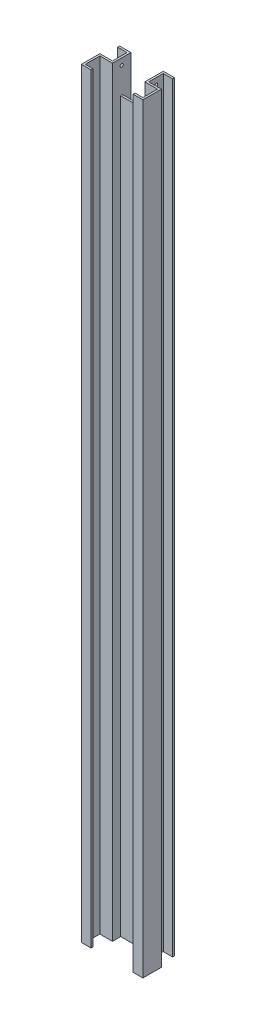
ISO-10303-21;
HEADER;
FILE_DESCRIPTION(('STEP AP214'),'2;1');
FILE_NAME('part.step','',(''),(''),'','','');
FILE_SCHEMA(('AUTOMOTIVE_DESIGN { 1 0 10303 214 1 1 1 1 }'));
ENDSEC;
DATA;
#1=APPLICATION_CONTEXT('core data for automotive mechanical design processes');
#2=APPLICATION_PROTOCOL_DEFINITION('international standard','automotive_design',2000,#1);
#3=PRODUCT_CONTEXT('',#1,'mechanical');
#4=PRODUCT('Part','Part','',(#3));
#5=PRODUCT_RELATED_PRODUCT_CATEGORY('part','',(#4));
#6=PRODUCT_DEFINITION_FORMATION('','',#4);
#7=PRODUCT_DEFINITION_CONTEXT('part definition',#1,'design');
#8=PRODUCT_DEFINITION('design','',#6,#7);
#9=PRODUCT_DEFINITION_SHAPE('','',#8);
#10=(LENGTH_UNIT() NAMED_UNIT(*) SI_UNIT(.MILLI.,.METRE.));
#11=(NAMED_UNIT(*) PLANE_ANGLE_UNIT() SI_UNIT($,.RADIAN.));
#12=(NAMED_UNIT(*) SI_UNIT($,.STERADIAN.) SOLID_ANGLE_UNIT());
#13=UNCERTAINTY_MEASURE_WITH_UNIT(LENGTH_MEASURE(1.E-05),#10,'distance_accuracy_value','');
#14=(GEOMETRIC_REPRESENTATION_CONTEXT(3) GLOBAL_UNCERTAINTY_ASSIGNED_CONTEXT((#13)) GLOBAL_UNIT_ASSIGNED_CONTEXT((#10,
#11,#12)) REPRESENTATION_CONTEXT('',''));
#15=CARTESIAN_POINT('',(0.,0.,0.));
#16=DIRECTION('',(0.,0.,1.));
#17=DIRECTION('',(1.,0.,0.));
#18=AXIS2_PLACEMENT_3D('',#15,#16,#17);
#19=CARTESIAN_POINT('',(-56.,-5.00000001402157E-05,-51.));
#20=DIRECTION('',(1.,0.,0.));
#21=DIRECTION('',(0.,0.,-1.));
#22=AXIS2_PLACEMENT_3D('',#19,#20,#21);
#23=PLANE('',#22);
#24=CARTESIAN_POINT('',(-56.,2330.,-73.5));
#25=DIRECTION('',(-1.,0.,0.));
#26=DIRECTION('',(0.,0.,1.));
#27=AXIS2_PLACEMENT_3D('',#24,#25,#26);
#28=CIRCLE('',#27,4.99999999999989);
#29=CARTESIAN_POINT('',(-56.,2330.,-68.5000000000001));
#30=VERTEX_POINT('',#29);
#31=EDGE_CURVE('E561',#30,#30,#28,.T.);
#32=ORIENTED_EDGE('',*,*,#31,.F.);
#33=EDGE_LOOP('',(#32));
#34=FACE_BOUND('',#33,.T.);
#35=DIRECTION('',(0.,1.,0.));
#36=VECTOR('',#35,1.);
#37=CARTESIAN_POINT('',(-56.,2350.,-96.));
#38=LINE('',#37,#36);
#39=CARTESIAN_POINT('',(-56.,0.,-96.));
#40=VERTEX_POINT('',#39);
#41=CARTESIAN_POINT('',(-56.,2350.,-96.));
#42=VERTEX_POINT('',#41);
#43=EDGE_CURVE('E243',#40,#42,#38,.T.);
#44=ORIENTED_EDGE('',*,*,#43,.F.);
#45=DIRECTION('',(0.,0.,1.));
#46=VECTOR('',#45,1.);
#47=CARTESIAN_POINT('',(-56.,0.,-44.9999999999998));
#48=LINE('',#47,#46);
#49=CARTESIAN_POINT('',(-56.,0.,-51.));
#50=VERTEX_POINT('',#49);
#51=EDGE_CURVE('E258',#40,#50,#48,.T.);
#52=ORIENTED_EDGE('',*,*,#51,.T.);
#53=DIRECTION('',(0.,1.,0.));
#54=VECTOR('',#53,1.);
#55=CARTESIAN_POINT('',(-56.,-5.00000001402157E-05,-51.));
#56=LINE('',#55,#54);
#57=CARTESIAN_POINT('',(-56.,2350.,-51.));
#58=VERTEX_POINT('',#57);
#59=EDGE_CURVE('E256',#50,#58,#56,.T.);
#60=ORIENTED_EDGE('',*,*,#59,.T.);
#61=DIRECTION('',(0.,0.,-1.));
#62=VECTOR('',#61,1.);
#63=CARTESIAN_POINT('',(-56.,2350.,-51.));
#64=LINE('',#63,#62);
#65=EDGE_CURVE('E51',#58,#42,#64,.T.);
#66=ORIENTED_EDGE('',*,*,#65,.T.);
#67=EDGE_LOOP('',(#44,#52,#60,#66));
#68=FACE_BOUND('',#67,.T.);
#69=ADVANCED_FACE('F34',(#34,#68),#23,.F.);
#70=CARTESIAN_POINT('',(0.,0.,-76.5));
#71=DIRECTION('',(0.,0.,-1.));
#72=DIRECTION('',(-1.,0.,0.));
#73=AXIS2_PLACEMENT_3D('',#70,#71,#72);
#74=PLANE('',#73);
#75=DIRECTION('',(-1.,0.,0.));
#76=VECTOR('',#75,1.);
#77=CARTESIAN_POINT('',(95.,0.,-76.5));
#78=LINE('',#77,#76);
#79=CARTESIAN_POINT('',(49.9999999999997,0.,-76.5));
#80=VERTEX_POINT('',#79);
#81=CARTESIAN_POINT('',(-50.0000000000004,0.,-76.5000000000002));
#82=VERTEX_POINT('',#81);
#83=EDGE_CURVE('E423',#80,#82,#78,.T.);
#84=ORIENTED_EDGE('',*,*,#83,.T.);
#85=DIRECTION('',(0.,-1.,0.));
#86=VECTOR('',#85,1.);
#87=CARTESIAN_POINT('',(-50.0000000000004,0.,-76.5000000000002));
#88=LINE('',#87,#86);
#89=CARTESIAN_POINT('',(-50.0000000000004,2250.,-76.5000000000002));
#90=VERTEX_POINT('',#89);
#91=EDGE_CURVE('E263',#90,#82,#88,.T.);
#92=ORIENTED_EDGE('',*,*,#91,.F.);
#93=DIRECTION('',(-1.,0.,0.));
#94=VECTOR('',#93,1.);
#95=CARTESIAN_POINT('',(50.,2250.,-76.5));
#96=LINE('',#95,#94);
#97=CARTESIAN_POINT('',(50.,2250.,-76.5));
#98=VERTEX_POINT('',#97);
#99=EDGE_CURVE('E320',#98,#90,#96,.T.);
#100=ORIENTED_EDGE('',*,*,#99,.F.);
#101=DIRECTION('',(0.,1.,0.));
#102=VECTOR('',#101,1.);
#103=CARTESIAN_POINT('',(49.9999999999997,2350.,-76.4999999999998));
#104=LINE('',#103,#102);
#105=EDGE_CURVE('E303',#80,#98,#104,.T.);
#106=ORIENTED_EDGE('',*,*,#105,.F.);
#107=EDGE_LOOP('',(#84,#92,#100,#106));
#108=FACE_BOUND('',#107,.T.);
#109=ADVANCED_FACE('F512',(#108),#74,.T.);
#110=CARTESIAN_POINT('',(56.,2350.,-51.));
#111=DIRECTION('',(-1.,0.,0.));
#112=DIRECTION('',(0.,0.,1.));
#113=AXIS2_PLACEMENT_3D('',#110,#111,#112);
#114=PLANE('',#113);
#115=CARTESIAN_POINT('',(56.,2330.,-73.5));
#116=DIRECTION('',(-1.,0.,0.));
#117=DIRECTION('',(0.,0.,1.));
#118=AXIS2_PLACEMENT_3D('',#115,#116,#117);
#119=CIRCLE('',#118,4.99999999999989);
#120=CARTESIAN_POINT('',(56.,2330.,-68.5000000000001));
#121=VERTEX_POINT('',#120);
#122=EDGE_CURVE('E564',#121,#121,#119,.T.);
#123=ORIENTED_EDGE('',*,*,#122,.T.);
#124=EDGE_LOOP('',(#123));
#125=FACE_BOUND('',#124,.T.);
#126=DIRECTION('',(0.,-1.,0.));
#127=VECTOR('',#126,1.);
#128=CARTESIAN_POINT('',(56.,0.,-96.));
#129=LINE('',#128,#127);
#130=CARTESIAN_POINT('',(56.,2350.,-96.));
#131=VERTEX_POINT('',#130);
#132=CARTESIAN_POINT('',(56.,0.,-96.));
#133=VERTEX_POINT('',#132);
#134=EDGE_CURVE('E59',#131,#133,#129,.T.);
#135=ORIENTED_EDGE('',*,*,#134,.F.);
#136=DIRECTION('',(0.,0.,-1.));
#137=VECTOR('',#136,1.);
#138=CARTESIAN_POINT('',(56.,2350.,-51.));
#139=LINE('',#138,#137);
#140=CARTESIAN_POINT('',(56.,2350.,-51.));
#141=VERTEX_POINT('',#140);
#142=EDGE_CURVE('E294',#141,#131,#139,.T.);
#143=ORIENTED_EDGE('',*,*,#142,.F.);
#144=DIRECTION('',(0.,-1.,0.));
#145=VECTOR('',#144,1.);
#146=CARTESIAN_POINT('',(56.,2350.,-51.));
#147=LINE('',#146,#145);
#148=CARTESIAN_POINT('',(56.,0.,-51.));
#149=VERTEX_POINT('',#148);
#150=EDGE_CURVE('E301',#141,#149,#147,.T.);
#151=ORIENTED_EDGE('',*,*,#150,.T.);
#152=DIRECTION('',(0.,0.,-1.));
#153=VECTOR('',#152,1.);
#154=CARTESIAN_POINT('',(56.,0.,-51.));
#155=LINE('',#154,#153);
#156=EDGE_CURVE('E295',#149,#133,#155,.T.);
#157=ORIENTED_EDGE('',*,*,#156,.T.);
#158=EDGE_LOOP('',(#135,#143,#151,#157));
#159=FACE_BOUND('',#158,.T.);
#160=ADVANCED_FACE('F485',(#125,#159),#114,.F.);
#161=CARTESIAN_POINT('',(49.9999999999999,2350.,-44.9999999999999));
#162=DIRECTION('',(0.,1.,0.));
#163=DIRECTION('',(0.,0.,1.));
#164=AXIS2_PLACEMENT_3D('',#161,#162,#163);
#165=PLANE('',#164);
#166=ORIENTED_EDGE('',*,*,#142,.T.);
#167=DIRECTION('',(-1.,0.,0.));
#168=VECTOR('',#167,1.);
#169=CARTESIAN_POINT('',(85.,2350.,-96.));
#170=LINE('',#169,#168);
#171=CARTESIAN_POINT('',(85.,2350.,-96.));
#172=VERTEX_POINT('',#171);
#173=EDGE_CURVE('E287',#172,#131,#170,.T.);
#174=ORIENTED_EDGE('',*,*,#173,.F.);
#175=DIRECTION('',(0.,0.,1.));
#176=VECTOR('',#175,1.);
#177=CARTESIAN_POINT('',(85.,2350.,-96.));
#178=LINE('',#177,#176);
#179=CARTESIAN_POINT('',(85.,2350.,-102.));
#180=VERTEX_POINT('',#179);
#181=EDGE_CURVE('E276',#180,#172,#178,.T.);
#182=ORIENTED_EDGE('',*,*,#181,.F.);
#183=DIRECTION('',(1.,0.,0.));
#184=VECTOR('',#183,1.);
#185=CARTESIAN_POINT('',(94.9999999999998,2350.,-102.));
#186=LINE('',#185,#184);
#187=CARTESIAN_POINT('',(49.9999999999998,2350.,-102.));
#188=VERTEX_POINT('',#187);
#189=EDGE_CURVE('E310',#188,#180,#186,.T.);
#190=ORIENTED_EDGE('',*,*,#189,.F.);
#191=DIRECTION('',(0.,0.,-1.));
#192=VECTOR('',#191,1.);
#193=CARTESIAN_POINT('',(49.9999999999999,2350.,-44.9999999999999));
#194=LINE('',#193,#192);
#195=CARTESIAN_POINT('',(49.9999999999999,2350.,-44.9999999999999));
#196=VERTEX_POINT('',#195);
#197=EDGE_CURVE('E43',#196,#188,#194,.T.);
#198=ORIENTED_EDGE('',*,*,#197,.F.);
#199=DIRECTION('',(1.,0.,0.));
#200=VECTOR('',#199,1.);
#201=CARTESIAN_POINT('',(49.9999999999999,2350.,-44.9999999999999));
#202=LINE('',#201,#200);
#203=CARTESIAN_POINT('',(88.9999999999998,2350.,-44.9999999999998));
#204=VERTEX_POINT('',#203);
#205=EDGE_CURVE('E430',#196,#204,#202,.T.);
#206=ORIENTED_EDGE('',*,*,#205,.T.);
#207=DIRECTION('',(0.,0.,-1.));
#208=VECTOR('',#207,1.);
#209=CARTESIAN_POINT('',(88.9999999999998,2350.,6.00000000000016));
#210=LINE('',#209,#208);
#211=CARTESIAN_POINT('',(88.9999999999998,2350.,2.00805084366041E-12));
#212=VERTEX_POINT('',#211);
#213=EDGE_CURVE('E382',#212,#204,#210,.T.);
#214=ORIENTED_EDGE('',*,*,#213,.F.);
#215=DIRECTION('',(1.,0.,0.));
#216=VECTOR('',#215,1.);
#217=CARTESIAN_POINT('',(64.9999999999998,2350.,2.00805084366041E-12));
#218=LINE('',#217,#216);
#219=CARTESIAN_POINT('',(64.9999999999998,2350.,2.00805084366041E-12));
#220=VERTEX_POINT('',#219);
#221=EDGE_CURVE('E371',#220,#212,#218,.T.);
#222=ORIENTED_EDGE('',*,*,#221,.F.);
#223=DIRECTION('',(0.,0.,-1.));
#224=VECTOR('',#223,1.);
#225=CARTESIAN_POINT('',(64.9999999999998,2350.,2.00805084366041E-12));
#226=LINE('',#225,#224);
#227=CARTESIAN_POINT('',(64.9999999999998,2350.,6.));
#228=VERTEX_POINT('',#227);
#229=EDGE_CURVE('E360',#228,#220,#226,.T.);
#230=ORIENTED_EDGE('',*,*,#229,.F.);
#231=DIRECTION('',(-1.,0.,0.));
#232=VECTOR('',#231,1.);
#233=CARTESIAN_POINT('',(88.9999999999998,2350.,6.00000000000016));
#234=LINE('',#233,#232);
#235=CARTESIAN_POINT('',(94.9999999999998,2350.,6.00000000000016));
#236=VERTEX_POINT('',#235);
#237=EDGE_CURVE('E380',#236,#228,#234,.T.);
#238=ORIENTED_EDGE('',*,*,#237,.F.);
#239=DIRECTION('',(0.,0.,-1.));
#240=VECTOR('',#239,1.);
#241=CARTESIAN_POINT('',(95.,2350.,-44.9999999999999));
#242=LINE('',#241,#240);
#243=CARTESIAN_POINT('',(95.,2350.,-51.));
#244=VERTEX_POINT('',#243);
#245=EDGE_CURVE('E11',#236,#244,#242,.T.);
#246=ORIENTED_EDGE('',*,*,#245,.T.);
#247=DIRECTION('',(-1.,0.,0.));
#248=VECTOR('',#247,1.);
#249=CARTESIAN_POINT('',(95.,2350.,-51.));
#250=LINE('',#249,#248);
#251=EDGE_CURVE('E291',#244,#141,#250,.T.);
#252=ORIENTED_EDGE('',*,*,#251,.T.);
#253=EDGE_LOOP('',(#166,#174,#182,#190,#198,#206,#214,#222,#230,#238,#246,#252));
#254=FACE_BOUND('',#253,.T.);
#255=ADVANCED_FACE('F466',(#254),#165,.T.);
#256=CARTESIAN_POINT('',(-95.0000000000001,2350.,-70.4999999999997));
#257=DIRECTION('',(0.,0.,-1.));
#258=DIRECTION('',(-1.,0.,0.));
#259=AXIS2_PLACEMENT_3D('',#256,#257,#258);
#260=PLANE('',#259);
#261=DIRECTION('',(1.,0.,0.));
#262=VECTOR('',#261,1.);
#263=CARTESIAN_POINT('',(-50.,2250.,-70.5));
#264=LINE('',#263,#262);
#265=CARTESIAN_POINT('',(-50.,2250.,-70.5));
#266=VERTEX_POINT('',#265);
#267=CARTESIAN_POINT('',(50.,2250.,-70.5));
#268=VERTEX_POINT('',#267);
#269=EDGE_CURVE('E319',#266,#268,#264,.T.);
#270=ORIENTED_EDGE('',*,*,#269,.F.);
#271=DIRECTION('',(0.,1.,0.));
#272=VECTOR('',#271,1.);
#273=CARTESIAN_POINT('',(-50.,2350.,-70.4999999999997));
#274=LINE('',#273,#272);
#275=CARTESIAN_POINT('',(-50.,0.,-70.4999999999997));
#276=VERTEX_POINT('',#275);
#277=EDGE_CURVE('E388',#276,#266,#274,.T.);
#278=ORIENTED_EDGE('',*,*,#277,.F.);
#279=DIRECTION('',(1.,0.,0.));
#280=VECTOR('',#279,1.);
#281=CARTESIAN_POINT('',(-95.0000000000001,0.,-70.4999999999997));
#282=LINE('',#281,#280);
#283=CARTESIAN_POINT('',(49.9999999999999,0.,-70.4999999999997));
#284=VERTEX_POINT('',#283);
#285=EDGE_CURVE('E409',#276,#284,#282,.T.);
#286=ORIENTED_EDGE('',*,*,#285,.T.);
#287=DIRECTION('',(0.,1.,0.));
#288=VECTOR('',#287,1.);
#289=CARTESIAN_POINT('',(49.9999999999999,2350.,-70.4999999999997));
#290=LINE('',#289,#288);
#291=EDGE_CURVE('E403',#284,#268,#290,.T.);
#292=ORIENTED_EDGE('',*,*,#291,.T.);
#293=EDGE_LOOP('',(#270,#278,#286,#292));
#294=FACE_BOUND('',#293,.T.);
#295=ADVANCED_FACE('F520',(#294),#260,.F.);
#296=CARTESIAN_POINT('',(-50.,2350.,6.00000000000024));
#297=DIRECTION('',(-1.,0.,0.));
#298=DIRECTION('',(0.,0.,1.));
#299=AXIS2_PLACEMENT_3D('',#296,#297,#298);
#300=PLANE('',#299);
#301=CARTESIAN_POINT('',(-50.,2330.,-73.5));
#302=DIRECTION('',(-1.,0.,0.));
#303=DIRECTION('',(0.,0.,1.));
#304=AXIS2_PLACEMENT_3D('',#301,#302,#303);
#305=CIRCLE('',#304,4.99999999999989);
#306=CARTESIAN_POINT('',(-50.,2330.,-68.5000000000001));
#307=VERTEX_POINT('',#306);
#308=EDGE_CURVE('E554',#307,#307,#305,.T.);
#309=ORIENTED_EDGE('',*,*,#308,.T.);
#310=EDGE_LOOP('',(#309));
#311=FACE_BOUND('',#310,.T.);
#312=DIRECTION('',(0.,1.,0.));
#313=VECTOR('',#312,1.);
#314=CARTESIAN_POINT('',(-50.,0.,-45.));
#315=LINE('',#314,#313);
#316=CARTESIAN_POINT('',(-50.,0.,-45.));
#317=VERTEX_POINT('',#316);
#318=CARTESIAN_POINT('',(-50.,2350.,-45.));
#319=VERTEX_POINT('',#318);
#320=EDGE_CURVE('E329',#317,#319,#315,.T.);
#321=ORIENTED_EDGE('',*,*,#320,.F.);
#322=DIRECTION('',(0.,0.,-1.));
#323=VECTOR('',#322,1.);
#324=CARTESIAN_POINT('',(-50.,0.,6.00000000000024));
#325=LINE('',#324,#323);
#326=EDGE_CURVE('E397',#317,#276,#325,.T.);
#327=ORIENTED_EDGE('',*,*,#326,.T.);
#328=ORIENTED_EDGE('',*,*,#277,.T.);
#329=DIRECTION('',(0.,0.,1.));
#330=VECTOR('',#329,1.);
#331=CARTESIAN_POINT('',(-50.0000000000001,2250.,-76.5));
#332=LINE('',#331,#330);
#333=EDGE_CURVE('E317',#90,#266,#332,.T.);
#334=ORIENTED_EDGE('',*,*,#333,.F.);
#335=ORIENTED_EDGE('',*,*,#91,.T.);
#336=DIRECTION('',(0.,0.,1.));
#337=VECTOR('',#336,1.);
#338=CARTESIAN_POINT('',(-50.0000000000003,0.,-102.));
#339=LINE('',#338,#337);
#340=CARTESIAN_POINT('',(-50.0000000000003,0.,-102.));
#341=VERTEX_POINT('',#340);
#342=EDGE_CURVE('E269',#341,#82,#339,.T.);
#343=ORIENTED_EDGE('',*,*,#342,.F.);
#344=DIRECTION('',(0.,-1.,0.));
#345=VECTOR('',#344,1.);
#346=CARTESIAN_POINT('',(-50.0000000000003,0.,-102.));
#347=LINE('',#346,#345);
#348=CARTESIAN_POINT('',(-50.0000000000003,2350.,-102.));
#349=VERTEX_POINT('',#348);
#350=EDGE_CURVE('E265',#349,#341,#347,.T.);
#351=ORIENTED_EDGE('',*,*,#350,.F.);
#352=DIRECTION('',(0.,0.,-1.));
#353=VECTOR('',#352,1.);
#354=CARTESIAN_POINT('',(-50.,2350.,6.00000000000024));
#355=LINE('',#354,#353);
#356=EDGE_CURVE('E401',#319,#349,#355,.T.);
#357=ORIENTED_EDGE('',*,*,#356,.F.);
#358=EDGE_LOOP('',(#321,#327,#328,#334,#335,#343,#351,#357));
#359=FACE_BOUND('',#358,.T.);
#360=ADVANCED_FACE('F516',(#311,#359),#300,.F.);
#361=ORIENTED_EDGE('',*,*,#65,.F.);
#362=DIRECTION('',(1.,0.,0.));
#363=VECTOR('',#362,1.);
#364=CARTESIAN_POINT('',(-95.,2350.,-51.));
#365=LINE('',#364,#363);
#366=CARTESIAN_POINT('',(-95.,2350.,-51.));
#367=VERTEX_POINT('',#366);
#368=EDGE_CURVE('E246',#367,#58,#365,.T.);
#369=ORIENTED_EDGE('',*,*,#368,.F.);
#370=DIRECTION('',(0.,0.,-1.));
#371=VECTOR('',#370,1.);
#372=CARTESIAN_POINT('',(-95.0000000000001,2350.,-76.5000000000003));
#373=LINE('',#372,#371);
#374=CARTESIAN_POINT('',(-95.,2350.,6.00000000000024));
#375=VERTEX_POINT('',#374);
#376=EDGE_CURVE('E404',#375,#367,#373,.T.);
#377=ORIENTED_EDGE('',*,*,#376,.F.);
#378=DIRECTION('',(-1.,0.,0.));
#379=VECTOR('',#378,1.);
#380=CARTESIAN_POINT('',(-95.,2350.,6.00000000000024));
#381=LINE('',#380,#379);
#382=CARTESIAN_POINT('',(-65.,2350.,6.00000000000024));
#383=VERTEX_POINT('',#382);
#384=EDGE_CURVE('E389',#383,#375,#381,.T.);
#385=ORIENTED_EDGE('',*,*,#384,.F.);
#386=DIRECTION('',(0.,0.,1.));
#387=VECTOR('',#386,1.);
#388=CARTESIAN_POINT('',(-65.,2350.,5.27355936696949E-13));
#389=LINE('',#388,#387);
#390=CARTESIAN_POINT('',(-65.,2350.,5.27355936696949E-13));
#391=VERTEX_POINT('',#390);
#392=EDGE_CURVE('E350',#391,#383,#389,.T.);
#393=ORIENTED_EDGE('',*,*,#392,.F.);
#394=DIRECTION('',(-1.,0.,0.));
#395=VECTOR('',#394,1.);
#396=CARTESIAN_POINT('',(-50.,2350.,0.));
#397=LINE('',#396,#395);
#398=CARTESIAN_POINT('',(-89.,2350.,0.));
#399=VERTEX_POINT('',#398);
#400=EDGE_CURVE('E327',#391,#399,#397,.T.);
#401=ORIENTED_EDGE('',*,*,#400,.T.);
#402=DIRECTION('',(0.,0.,1.));
#403=VECTOR('',#402,1.);
#404=CARTESIAN_POINT('',(-89.,2350.,-45.));
#405=LINE('',#404,#403);
#406=CARTESIAN_POINT('',(-89.,2350.,-45.));
#407=VERTEX_POINT('',#406);
#408=EDGE_CURVE('E343',#407,#399,#405,.T.);
#409=ORIENTED_EDGE('',*,*,#408,.F.);
#410=DIRECTION('',(-1.,0.,0.));
#411=VECTOR('',#410,1.);
#412=CARTESIAN_POINT('',(-50.,2350.,-45.));
#413=LINE('',#412,#411);
#414=EDGE_CURVE('E331',#319,#407,#413,.T.);
#415=ORIENTED_EDGE('',*,*,#414,.F.);
#416=ORIENTED_EDGE('',*,*,#356,.T.);
#417=DIRECTION('',(1.,0.,0.));
#418=VECTOR('',#417,1.);
#419=CARTESIAN_POINT('',(-50.0000000000003,2350.,-102.));
#420=LINE('',#419,#418);
#421=CARTESIAN_POINT('',(-85.,2350.,-102.));
#422=VERTEX_POINT('',#421);
#423=EDGE_CURVE('E229',#422,#349,#420,.T.);
#424=ORIENTED_EDGE('',*,*,#423,.F.);
#425=DIRECTION('',(0.,0.,-1.));
#426=VECTOR('',#425,1.);
#427=CARTESIAN_POINT('',(-85.,2350.,-102.));
#428=LINE('',#427,#426);
#429=CARTESIAN_POINT('',(-85.,2350.,-96.));
#430=VERTEX_POINT('',#429);
#431=EDGE_CURVE('E222',#430,#422,#428,.T.);
#432=ORIENTED_EDGE('',*,*,#431,.F.);
#433=DIRECTION('',(1.,0.,0.));
#434=VECTOR('',#433,1.);
#435=CARTESIAN_POINT('',(-85.,2350.,-96.));
#436=LINE('',#435,#434);
#437=EDGE_CURVE('E226',#430,#42,#436,.T.);
#438=ORIENTED_EDGE('',*,*,#437,.T.);
#439=EDGE_LOOP('',(#361,#369,#377,#385,#393,#401,#409,#415,#416,#424,#432,#438));
#440=FACE_BOUND('',#439,.T.);
#441=ADVANCED_FACE('F224',(#440),#165,.T.);
#442=CARTESIAN_POINT('',(95.,0.,-44.9999999999999));
#443=DIRECTION('',(0.,-1.,0.));
#444=DIRECTION('',(0.,0.,-1.));
#445=AXIS2_PLACEMENT_3D('',#442,#443,#444);
#446=PLANE('',#445);
#447=ORIENTED_EDGE('',*,*,#51,.F.);
#448=DIRECTION('',(1.,0.,0.));
#449=VECTOR('',#448,1.);
#450=CARTESIAN_POINT('',(-85.,0.,-96.));
#451=LINE('',#450,#449);
#452=CARTESIAN_POINT('',(-85.,0.,-96.));
#453=VERTEX_POINT('',#452);
#454=EDGE_CURVE('E247',#453,#40,#451,.T.);
#455=ORIENTED_EDGE('',*,*,#454,.F.);
#456=DIRECTION('',(0.,0.,1.));
#457=VECTOR('',#456,1.);
#458=CARTESIAN_POINT('',(-85.,0.,-96.));
#459=LINE('',#458,#457);
#460=CARTESIAN_POINT('',(-85.,0.,-102.));
#461=VERTEX_POINT('',#460);
#462=EDGE_CURVE('E239',#461,#453,#459,.T.);
#463=ORIENTED_EDGE('',*,*,#462,.F.);
#464=DIRECTION('',(-1.,0.,0.));
#465=VECTOR('',#464,1.);
#466=CARTESIAN_POINT('',(-95.0000000000003,0.,-102.));
#467=LINE('',#466,#465);
#468=EDGE_CURVE('E267',#341,#461,#467,.T.);
#469=ORIENTED_EDGE('',*,*,#468,.F.);
#470=ORIENTED_EDGE('',*,*,#342,.T.);
#471=ORIENTED_EDGE('',*,*,#83,.F.);
#472=DIRECTION('',(0.,0.,1.));
#473=VECTOR('',#472,1.);
#474=CARTESIAN_POINT('',(49.9999999999998,0.,-102.));
#475=LINE('',#474,#473);
#476=CARTESIAN_POINT('',(49.9999999999998,0.,-102.));
#477=VERTEX_POINT('',#476);
#478=EDGE_CURVE('E312',#477,#80,#475,.T.);
#479=ORIENTED_EDGE('',*,*,#478,.F.);
#480=DIRECTION('',(-1.,0.,0.));
#481=VECTOR('',#480,1.);
#482=CARTESIAN_POINT('',(49.9999999999998,0.,-102.));
#483=LINE('',#482,#481);
#484=CARTESIAN_POINT('',(85.,0.,-102.));
#485=VERTEX_POINT('',#484);
#486=EDGE_CURVE('E305',#485,#477,#483,.T.);
#487=ORIENTED_EDGE('',*,*,#486,.F.);
#488=DIRECTION('',(0.,0.,-1.));
#489=VECTOR('',#488,1.);
#490=CARTESIAN_POINT('',(85.,0.,-102.));
#491=LINE('',#490,#489);
#492=CARTESIAN_POINT('',(85.,0.,-96.));
#493=VERTEX_POINT('',#492);
#494=EDGE_CURVE('E280',#493,#485,#491,.T.);
#495=ORIENTED_EDGE('',*,*,#494,.F.);
#496=DIRECTION('',(-1.,0.,0.));
#497=VECTOR('',#496,1.);
#498=CARTESIAN_POINT('',(85.,0.,-96.));
#499=LINE('',#498,#497);
#500=EDGE_CURVE('E283',#493,#133,#499,.T.);
#501=ORIENTED_EDGE('',*,*,#500,.T.);
#502=ORIENTED_EDGE('',*,*,#156,.F.);
#503=DIRECTION('',(-1.,0.,0.));
#504=VECTOR('',#503,1.);
#505=CARTESIAN_POINT('',(95.,0.,-51.));
#506=LINE('',#505,#504);
#507=CARTESIAN_POINT('',(95.,0.,-51.));
#508=VERTEX_POINT('',#507);
#509=EDGE_CURVE('E290',#508,#149,#506,.T.);
#510=ORIENTED_EDGE('',*,*,#509,.F.);
#511=DIRECTION('',(0.,0.,-1.));
#512=VECTOR('',#511,1.);
#513=CARTESIAN_POINT('',(95.,0.,-44.9999999999999));
#514=LINE('',#513,#512);
#515=CARTESIAN_POINT('',(94.9999999999998,0.,6.00000000000016));
#516=VERTEX_POINT('',#515);
#517=EDGE_CURVE('E435',#516,#508,#514,.T.);
#518=ORIENTED_EDGE('',*,*,#517,.F.);
#519=DIRECTION('',(1.,0.,0.));
#520=VECTOR('',#519,1.);
#521=CARTESIAN_POINT('',(94.9999999999998,0.,6.00000000000016));
#522=LINE('',#521,#520);
#523=CARTESIAN_POINT('',(64.9999999999998,0.,6.));
#524=VERTEX_POINT('',#523);
#525=EDGE_CURVE('E374',#524,#516,#522,.T.);
#526=ORIENTED_EDGE('',*,*,#525,.F.);
#527=DIRECTION('',(0.,0.,1.));
#528=VECTOR('',#527,1.);
#529=CARTESIAN_POINT('',(64.9999999999998,0.,6.));
#530=LINE('',#529,#528);
#531=CARTESIAN_POINT('',(64.9999999999998,0.,2.00805084366041E-12));
#532=VERTEX_POINT('',#531);
#533=EDGE_CURVE('E364',#532,#524,#530,.T.);
#534=ORIENTED_EDGE('',*,*,#533,.F.);
#535=DIRECTION('',(1.,0.,0.));
#536=VECTOR('',#535,1.);
#537=CARTESIAN_POINT('',(64.9999999999998,0.,2.00805084366041E-12));
#538=LINE('',#537,#536);
#539=CARTESIAN_POINT('',(88.9999999999998,0.,2.00805084366041E-12));
#540=VERTEX_POINT('',#539);
#541=EDGE_CURVE('E367',#532,#540,#538,.T.);
#542=ORIENTED_EDGE('',*,*,#541,.T.);
#543=DIRECTION('',(0.,0.,-1.));
#544=VECTOR('',#543,1.);
#545=CARTESIAN_POINT('',(88.9999999999998,0.,6.00000000000016));
#546=LINE('',#545,#544);
#547=CARTESIAN_POINT('',(88.9999999999998,0.,-44.9999999999998));
#548=VERTEX_POINT('',#547);
#549=EDGE_CURVE('E386',#540,#548,#546,.T.);
#550=ORIENTED_EDGE('',*,*,#549,.T.);
#551=DIRECTION('',(-1.,0.,0.));
#552=VECTOR('',#551,1.);
#553=CARTESIAN_POINT('',(95.,0.,-44.9999999999999));
#554=LINE('',#553,#552);
#555=CARTESIAN_POINT('',(49.9999999999999,0.,-44.9999999999999));
#556=VERTEX_POINT('',#555);
#557=EDGE_CURVE('E412',#548,#556,#554,.T.);
#558=ORIENTED_EDGE('',*,*,#557,.T.);
#559=DIRECTION('',(0.,0.,-1.));
#560=VECTOR('',#559,1.);
#561=CARTESIAN_POINT('',(49.9999999999999,0.,-44.9999999999999));
#562=LINE('',#561,#560);
#563=EDGE_CURVE('E436',#556,#284,#562,.T.);
#564=ORIENTED_EDGE('',*,*,#563,.T.);
#565=ORIENTED_EDGE('',*,*,#285,.F.);
#566=ORIENTED_EDGE('',*,*,#326,.F.);
#567=DIRECTION('',(1.,0.,0.));
#568=VECTOR('',#567,1.);
#569=CARTESIAN_POINT('',(-89.,0.,-45.));
#570=LINE('',#569,#568);
#571=CARTESIAN_POINT('',(-89.,0.,-45.));
#572=VERTEX_POINT('',#571);
#573=EDGE_CURVE('E326',#572,#317,#570,.T.);
#574=ORIENTED_EDGE('',*,*,#573,.F.);
#575=DIRECTION('',(0.,0.,1.));
#576=VECTOR('',#575,1.);
#577=CARTESIAN_POINT('',(-89.,0.,-45.));
#578=LINE('',#577,#576);
#579=CARTESIAN_POINT('',(-89.,0.,0.));
#580=VERTEX_POINT('',#579);
#581=EDGE_CURVE('E334',#572,#580,#578,.T.);
#582=ORIENTED_EDGE('',*,*,#581,.T.);
#583=DIRECTION('',(1.,0.,0.));
#584=VECTOR('',#583,1.);
#585=CARTESIAN_POINT('',(-89.,0.,0.));
#586=LINE('',#585,#584);
#587=CARTESIAN_POINT('',(-65.,0.,0.));
#588=VERTEX_POINT('',#587);
#589=EDGE_CURVE('E338',#580,#588,#586,.T.);
#590=ORIENTED_EDGE('',*,*,#589,.T.);
#591=DIRECTION('',(0.,0.,1.));
#592=VECTOR('',#591,1.);
#593=CARTESIAN_POINT('',(-65.,0.,5.27355936696949E-13));
#594=LINE('',#593,#592);
#595=CARTESIAN_POINT('',(-65.,0.,6.00000000000024));
#596=VERTEX_POINT('',#595);
#597=EDGE_CURVE('E352',#588,#596,#594,.T.);
#598=ORIENTED_EDGE('',*,*,#597,.T.);
#599=DIRECTION('',(1.,0.,0.));
#600=VECTOR('',#599,1.);
#601=CARTESIAN_POINT('',(-50.,0.,6.00000000000024));
#602=LINE('',#601,#600);
#603=CARTESIAN_POINT('',(-95.,0.,6.00000000000024));
#604=VERTEX_POINT('',#603);
#605=EDGE_CURVE('E394',#604,#596,#602,.T.);
#606=ORIENTED_EDGE('',*,*,#605,.F.);
#607=DIRECTION('',(0.,0.,1.));
#608=VECTOR('',#607,1.);
#609=CARTESIAN_POINT('',(-95.0000000000001,0.,-70.4999999999997));
#610=LINE('',#609,#608);
#611=CARTESIAN_POINT('',(-95.,0.,-51.));
#612=VERTEX_POINT('',#611);
#613=EDGE_CURVE('E407',#612,#604,#610,.T.);
#614=ORIENTED_EDGE('',*,*,#613,.F.);
#615=DIRECTION('',(-1.,0.,0.));
#616=VECTOR('',#615,1.);
#617=CARTESIAN_POINT('',(95.,0.,-51.));
#618=LINE('',#617,#616);
#619=EDGE_CURVE('E261',#50,#612,#618,.T.);
#620=ORIENTED_EDGE('',*,*,#619,.F.);
#621=EDGE_LOOP('',(#447,#455,#463,#469,#470,#471,#479,#487,#495,#501,#502,#510,#518,#526,#534,
#542,#550,#558,#564,#565,#566,#574,#582,#590,#598,#606,#614,#620));
#622=FACE_BOUND('',#621,.T.);
#623=ADVANCED_FACE('F454',(#622),#446,.T.);
#624=CARTESIAN_POINT('',(88.9999999999998,0.,6.00000000000016));
#625=DIRECTION('',(1.,0.,0.));
#626=DIRECTION('',(0.,0.,-1.));
#627=AXIS2_PLACEMENT_3D('',#624,#625,#626);
#628=PLANE('',#627);
#629=DIRECTION('',(0.,-1.,0.));
#630=VECTOR('',#629,1.);
#631=CARTESIAN_POINT('',(88.9999999999998,0.,2.00805084366041E-12));
#632=LINE('',#631,#630);
#633=EDGE_CURVE('E355',#212,#540,#632,.T.);
#634=ORIENTED_EDGE('',*,*,#633,.F.);
#635=ORIENTED_EDGE('',*,*,#213,.T.);
#636=DIRECTION('',(0.,-1.,0.));
#637=VECTOR('',#636,1.);
#638=CARTESIAN_POINT('',(88.9999999999998,0.,-44.9999999999998));
#639=LINE('',#638,#637);
#640=EDGE_CURVE('E373',#204,#548,#639,.T.);
#641=ORIENTED_EDGE('',*,*,#640,.T.);
#642=ORIENTED_EDGE('',*,*,#549,.F.);
#643=EDGE_LOOP('',(#634,#635,#641,#642));
#644=FACE_BOUND('',#643,.T.);
#645=ADVANCED_FACE('F464',(#644),#628,.F.);
#646=CARTESIAN_POINT('',(0.,0.,-44.9999999999998));
#647=DIRECTION('',(0.,0.,-1.));
#648=DIRECTION('',(-1.,0.,0.));
#649=AXIS2_PLACEMENT_3D('',#646,#647,#648);
#650=PLANE('',#649);
#651=ORIENTED_EDGE('',*,*,#640,.F.);
#652=ORIENTED_EDGE('',*,*,#205,.F.);
#653=DIRECTION('',(0.,1.,0.));
#654=VECTOR('',#653,1.);
#655=CARTESIAN_POINT('',(49.9999999999999,0.,-44.9999999999999));
#656=LINE('',#655,#654);
#657=EDGE_CURVE('E446',#556,#196,#656,.T.);
#658=ORIENTED_EDGE('',*,*,#657,.F.);
#659=ORIENTED_EDGE('',*,*,#557,.F.);
#660=EDGE_LOOP('',(#651,#652,#658,#659));
#661=FACE_BOUND('',#660,.T.);
#662=ADVANCED_FACE('F461',(#661),#650,.F.);
#663=CARTESIAN_POINT('',(95.,2350.,-44.9999999999999));
#664=DIRECTION('',(1.,0.,0.));
#665=DIRECTION('',(0.,0.,-1.));
#666=AXIS2_PLACEMENT_3D('',#663,#664,#665);
#667=PLANE('',#666);
#668=DIRECTION('',(0.,-1.,0.));
#669=VECTOR('',#668,1.);
#670=CARTESIAN_POINT('',(95.,2350.,-51.));
#671=LINE('',#670,#669);
#672=EDGE_CURVE('E297',#244,#508,#671,.T.);
#673=ORIENTED_EDGE('',*,*,#672,.F.);
#674=ORIENTED_EDGE('',*,*,#245,.F.);
#675=DIRECTION('',(0.,1.,0.));
#676=VECTOR('',#675,1.);
#677=CARTESIAN_POINT('',(94.9999999999998,2350.,6.00000000000016));
#678=LINE('',#677,#676);
#679=EDGE_CURVE('E377',#516,#236,#678,.T.);
#680=ORIENTED_EDGE('',*,*,#679,.F.);
#681=ORIENTED_EDGE('',*,*,#517,.T.);
#682=EDGE_LOOP('',(#673,#674,#680,#681));
#683=FACE_BOUND('',#682,.T.);
#684=ADVANCED_FACE('F36',(#683),#667,.T.);
#685=CARTESIAN_POINT('',(49.9999999999999,0.,-44.9999999999999));
#686=DIRECTION('',(-1.,0.,0.));
#687=DIRECTION('',(0.,0.,1.));
#688=AXIS2_PLACEMENT_3D('',#685,#686,#687);
#689=PLANE('',#688);
#690=CARTESIAN_POINT('',(49.9999999999999,2330.,-73.5));
#691=DIRECTION('',(-1.,0.,0.));
#692=DIRECTION('',(0.,0.,1.));
#693=AXIS2_PLACEMENT_3D('',#690,#691,#692);
#694=CIRCLE('',#693,4.99999999999989);
#695=CARTESIAN_POINT('',(49.9999999999999,2330.,-68.5000000000001));
#696=VERTEX_POINT('',#695);
#697=EDGE_CURVE('E567',#696,#696,#694,.T.);
#698=ORIENTED_EDGE('',*,*,#697,.F.);
#699=EDGE_LOOP('',(#698));
#700=FACE_BOUND('',#699,.T.);
#701=ORIENTED_EDGE('',*,*,#291,.F.);
#702=ORIENTED_EDGE('',*,*,#563,.F.);
#703=ORIENTED_EDGE('',*,*,#657,.T.);
#704=ORIENTED_EDGE('',*,*,#197,.T.);
#705=DIRECTION('',(0.,1.,0.));
#706=VECTOR('',#705,1.);
#707=CARTESIAN_POINT('',(49.9999999999998,2350.,-102.));
#708=LINE('',#707,#706);
#709=EDGE_CURVE('E307',#477,#188,#708,.T.);
#710=ORIENTED_EDGE('',*,*,#709,.F.);
#711=ORIENTED_EDGE('',*,*,#478,.T.);
#712=ORIENTED_EDGE('',*,*,#105,.T.);
#713=DIRECTION('',(0.,0.,-1.));
#714=VECTOR('',#713,1.);
#715=CARTESIAN_POINT('',(50.,2250.,-70.5));
#716=LINE('',#715,#714);
#717=EDGE_CURVE('E322',#268,#98,#716,.T.);
#718=ORIENTED_EDGE('',*,*,#717,.F.);
#719=EDGE_LOOP('',(#701,#702,#703,#704,#710,#711,#712,#718));
#720=FACE_BOUND('',#719,.T.);
#721=ADVANCED_FACE('F459',(#700,#720),#689,.T.);
#722=CARTESIAN_POINT('',(-95.,0.,0.));
#723=DIRECTION('',(1.,0.,0.));
#724=DIRECTION('',(0.,0.,-1.));
#725=AXIS2_PLACEMENT_3D('',#722,#723,#724);
#726=PLANE('',#725);
#727=ORIENTED_EDGE('',*,*,#376,.T.);
#728=DIRECTION('',(0.,1.,0.));
#729=VECTOR('',#728,1.);
#730=CARTESIAN_POINT('',(-95.,-5.00000001402157E-05,-51.));
#731=LINE('',#730,#729);
#732=EDGE_CURVE('E255',#612,#367,#731,.T.);
#733=ORIENTED_EDGE('',*,*,#732,.F.);
#734=ORIENTED_EDGE('',*,*,#613,.T.);
#735=DIRECTION('',(0.,-1.,0.));
#736=VECTOR('',#735,1.);
#737=CARTESIAN_POINT('',(-95.,0.,6.00000000000024));
#738=LINE('',#737,#736);
#739=EDGE_CURVE('E391',#375,#604,#738,.T.);
#740=ORIENTED_EDGE('',*,*,#739,.F.);
#741=EDGE_LOOP('',(#727,#733,#734,#740));
#742=FACE_BOUND('',#741,.T.);
#743=ADVANCED_FACE('F548',(#742),#726,.F.);
#744=CARTESIAN_POINT('',(0.,0.,6.00000000000024));
#745=DIRECTION('',(0.,0.,-1.));
#746=DIRECTION('',(-1.,0.,0.));
#747=AXIS2_PLACEMENT_3D('',#744,#745,#746);
#748=PLANE('',#747);
#749=ORIENTED_EDGE('',*,*,#605,.T.);
#750=DIRECTION('',(0.,-1.,0.));
#751=VECTOR('',#750,1.);
#752=CARTESIAN_POINT('',(-65.,2350.,6.00000000000024));
#753=LINE('',#752,#751);
#754=EDGE_CURVE('E345',#383,#596,#753,.T.);
#755=ORIENTED_EDGE('',*,*,#754,.F.);
#756=ORIENTED_EDGE('',*,*,#384,.T.);
#757=ORIENTED_EDGE('',*,*,#739,.T.);
#758=EDGE_LOOP('',(#749,#755,#756,#757));
#759=FACE_BOUND('',#758,.T.);
#760=ADVANCED_FACE('F542',(#759),#748,.F.);
#761=CARTESIAN_POINT('',(0.,0.,6.00000000000016));
#762=DIRECTION('',(0.,0.,-1.));
#763=DIRECTION('',(-1.,0.,0.));
#764=AXIS2_PLACEMENT_3D('',#761,#762,#763);
#765=PLANE('',#764);
#766=ORIENTED_EDGE('',*,*,#237,.T.);
#767=DIRECTION('',(0.,1.,0.));
#768=VECTOR('',#767,1.);
#769=CARTESIAN_POINT('',(64.9999999999998,2350.,6.));
#770=LINE('',#769,#768);
#771=EDGE_CURVE('E357',#524,#228,#770,.T.);
#772=ORIENTED_EDGE('',*,*,#771,.F.);
#773=ORIENTED_EDGE('',*,*,#525,.T.);
#774=ORIENTED_EDGE('',*,*,#679,.T.);
#775=EDGE_LOOP('',(#766,#772,#773,#774));
#776=FACE_BOUND('',#775,.T.);
#777=ADVANCED_FACE('F478',(#776),#765,.F.);
#778=CARTESIAN_POINT('',(64.9999999999998,0.,2.00805084366041E-12));
#779=DIRECTION('',(0.,0.,1.));
#780=DIRECTION('',(1.,0.,0.));
#781=AXIS2_PLACEMENT_3D('',#778,#779,#780);
#782=PLANE('',#781);
#783=ORIENTED_EDGE('',*,*,#633,.T.);
#784=ORIENTED_EDGE('',*,*,#541,.F.);
#785=DIRECTION('',(0.,-1.,0.));
#786=VECTOR('',#785,1.);
#787=CARTESIAN_POINT('',(64.9999999999998,0.,2.00805084366041E-12));
#788=LINE('',#787,#786);
#789=EDGE_CURVE('E362',#220,#532,#788,.T.);
#790=ORIENTED_EDGE('',*,*,#789,.F.);
#791=ORIENTED_EDGE('',*,*,#221,.T.);
#792=EDGE_LOOP('',(#783,#784,#790,#791));
#793=FACE_BOUND('',#792,.T.);
#794=ADVANCED_FACE('F472',(#793),#782,.F.);
#795=CARTESIAN_POINT('',(64.9999999999998,0.,0.));
#796=DIRECTION('',(1.,0.,0.));
#797=DIRECTION('',(0.,0.,-1.));
#798=AXIS2_PLACEMENT_3D('',#795,#796,#797);
#799=PLANE('',#798);
#800=ORIENTED_EDGE('',*,*,#771,.T.);
#801=ORIENTED_EDGE('',*,*,#229,.T.);
#802=ORIENTED_EDGE('',*,*,#789,.T.);
#803=ORIENTED_EDGE('',*,*,#533,.T.);
#804=EDGE_LOOP('',(#800,#801,#802,#803));
#805=FACE_BOUND('',#804,.T.);
#806=ADVANCED_FACE('F475',(#805),#799,.F.);
#807=CARTESIAN_POINT('',(-65.,2350.,5.27355936696949E-13));
#808=DIRECTION('',(-1.,0.,0.));
#809=DIRECTION('',(0.,0.,1.));
#810=AXIS2_PLACEMENT_3D('',#807,#808,#809);
#811=PLANE('',#810);
#812=ORIENTED_EDGE('',*,*,#754,.T.);
#813=ORIENTED_EDGE('',*,*,#597,.F.);
#814=DIRECTION('',(0.,-1.,0.));
#815=VECTOR('',#814,1.);
#816=CARTESIAN_POINT('',(-65.,2350.,5.27355936696949E-13));
#817=LINE('',#816,#815);
#818=EDGE_CURVE('E348',#391,#588,#817,.T.);
#819=ORIENTED_EDGE('',*,*,#818,.F.);
#820=ORIENTED_EDGE('',*,*,#392,.T.);
#821=EDGE_LOOP('',(#812,#813,#819,#820));
#822=FACE_BOUND('',#821,.T.);
#823=ADVANCED_FACE('F538',(#822),#811,.F.);
#824=CARTESIAN_POINT('',(0.,0.,0.));
#825=DIRECTION('',(0.,0.,1.));
#826=DIRECTION('',(1.,0.,0.));
#827=AXIS2_PLACEMENT_3D('',#824,#825,#826);
#828=PLANE('',#827);
#829=ORIENTED_EDGE('',*,*,#589,.F.);
#830=DIRECTION('',(0.,-1.,0.));
#831=VECTOR('',#830,1.);
#832=CARTESIAN_POINT('',(-89.,2350.,0.));
#833=LINE('',#832,#831);
#834=EDGE_CURVE('E335',#399,#580,#833,.T.);
#835=ORIENTED_EDGE('',*,*,#834,.F.);
#836=ORIENTED_EDGE('',*,*,#400,.F.);
#837=ORIENTED_EDGE('',*,*,#818,.T.);
#838=EDGE_LOOP('',(#829,#835,#836,#837));
#839=FACE_BOUND('',#838,.T.);
#840=ADVANCED_FACE('F533',(#839),#828,.F.);
#841=CARTESIAN_POINT('',(-89.,2350.,-45.));
#842=DIRECTION('',(-1.,0.,0.));
#843=DIRECTION('',(0.,0.,1.));
#844=AXIS2_PLACEMENT_3D('',#841,#842,#843);
#845=PLANE('',#844);
#846=ORIENTED_EDGE('',*,*,#834,.T.);
#847=ORIENTED_EDGE('',*,*,#581,.F.);
#848=DIRECTION('',(0.,-1.,0.));
#849=VECTOR('',#848,1.);
#850=CARTESIAN_POINT('',(-89.,2350.,-45.));
#851=LINE('',#850,#849);
#852=EDGE_CURVE('E323',#407,#572,#851,.T.);
#853=ORIENTED_EDGE('',*,*,#852,.F.);
#854=ORIENTED_EDGE('',*,*,#408,.T.);
#855=EDGE_LOOP('',(#846,#847,#853,#854));
#856=FACE_BOUND('',#855,.T.);
#857=ADVANCED_FACE('F531',(#856),#845,.F.);
#858=CARTESIAN_POINT('',(0.,0.,-45.));
#859=DIRECTION('',(0.,0.,1.));
#860=DIRECTION('',(1.,0.,0.));
#861=AXIS2_PLACEMENT_3D('',#858,#859,#860);
#862=PLANE('',#861);
#863=ORIENTED_EDGE('',*,*,#852,.T.);
#864=ORIENTED_EDGE('',*,*,#573,.T.);
#865=ORIENTED_EDGE('',*,*,#320,.T.);
#866=ORIENTED_EDGE('',*,*,#414,.T.);
#867=EDGE_LOOP('',(#863,#864,#865,#866));
#868=FACE_BOUND('',#867,.T.);
#869=ADVANCED_FACE('F523',(#868),#862,.T.);
#870=CARTESIAN_POINT('',(0.,2250.,0.));
#871=DIRECTION('',(0.,1.,0.));
#872=DIRECTION('',(0.,0.,1.));
#873=AXIS2_PLACEMENT_3D('',#870,#871,#872);
#874=PLANE('',#873);
#875=ORIENTED_EDGE('',*,*,#99,.T.);
#876=ORIENTED_EDGE('',*,*,#333,.T.);
#877=ORIENTED_EDGE('',*,*,#269,.T.);
#878=ORIENTED_EDGE('',*,*,#717,.T.);
#879=EDGE_LOOP('',(#875,#876,#877,#878));
#880=FACE_BOUND('',#879,.T.);
#881=ADVANCED_FACE('F508',(#880),#874,.T.);
#882=CARTESIAN_POINT('',(3.77475828372553E-13,0.,-102.));
#883=DIRECTION('',(0.,0.,1.));
#884=DIRECTION('',(1.,0.,0.));
#885=AXIS2_PLACEMENT_3D('',#882,#883,#884);
#886=PLANE('',#885);
#887=ORIENTED_EDGE('',*,*,#189,.T.);
#888=DIRECTION('',(0.,1.,0.));
#889=VECTOR('',#888,1.);
#890=CARTESIAN_POINT('',(85.,2350.,-102.));
#891=LINE('',#890,#889);
#892=EDGE_CURVE('E273',#485,#180,#891,.T.);
#893=ORIENTED_EDGE('',*,*,#892,.F.);
#894=ORIENTED_EDGE('',*,*,#486,.T.);
#895=ORIENTED_EDGE('',*,*,#709,.T.);
#896=EDGE_LOOP('',(#887,#893,#894,#895));
#897=FACE_BOUND('',#896,.T.);
#898=ADVANCED_FACE('F496',(#897),#886,.F.);
#899=CARTESIAN_POINT('',(95.,2350.,-51.));
#900=DIRECTION('',(0.,0.,1.));
#901=DIRECTION('',(1.,0.,0.));
#902=AXIS2_PLACEMENT_3D('',#899,#900,#901);
#903=PLANE('',#902);
#904=ORIENTED_EDGE('',*,*,#509,.T.);
#905=ORIENTED_EDGE('',*,*,#150,.F.);
#906=ORIENTED_EDGE('',*,*,#251,.F.);
#907=ORIENTED_EDGE('',*,*,#672,.T.);
#908=EDGE_LOOP('',(#904,#905,#906,#907));
#909=FACE_BOUND('',#908,.T.);
#910=ADVANCED_FACE('F481',(#909),#903,.F.);
#911=CARTESIAN_POINT('',(85.,0.,-96.));
#912=DIRECTION('',(0.,0.,-1.));
#913=DIRECTION('',(-1.,0.,0.));
#914=AXIS2_PLACEMENT_3D('',#911,#912,#913);
#915=PLANE('',#914);
#916=ORIENTED_EDGE('',*,*,#134,.T.);
#917=ORIENTED_EDGE('',*,*,#500,.F.);
#918=DIRECTION('',(0.,-1.,0.));
#919=VECTOR('',#918,1.);
#920=CARTESIAN_POINT('',(85.,0.,-96.));
#921=LINE('',#920,#919);
#922=EDGE_CURVE('E278',#172,#493,#921,.T.);
#923=ORIENTED_EDGE('',*,*,#922,.F.);
#924=ORIENTED_EDGE('',*,*,#173,.T.);
#925=EDGE_LOOP('',(#916,#917,#923,#924));
#926=FACE_BOUND('',#925,.T.);
#927=ADVANCED_FACE('F487',(#926),#915,.F.);
#928=CARTESIAN_POINT('',(85.,0.,0.));
#929=DIRECTION('',(-1.,0.,0.));
#930=DIRECTION('',(0.,0.,1.));
#931=AXIS2_PLACEMENT_3D('',#928,#929,#930);
#932=PLANE('',#931);
#933=ORIENTED_EDGE('',*,*,#892,.T.);
#934=ORIENTED_EDGE('',*,*,#181,.T.);
#935=ORIENTED_EDGE('',*,*,#922,.T.);
#936=ORIENTED_EDGE('',*,*,#494,.T.);
#937=EDGE_LOOP('',(#933,#934,#935,#936));
#938=FACE_BOUND('',#937,.T.);
#939=ADVANCED_FACE('F494',(#938),#932,.F.);
#940=CARTESIAN_POINT('',(3.77475828372553E-13,0.,-102.));
#941=DIRECTION('',(0.,0.,1.));
#942=DIRECTION('',(1.,0.,0.));
#943=AXIS2_PLACEMENT_3D('',#940,#941,#942);
#944=PLANE('',#943);
#945=ORIENTED_EDGE('',*,*,#468,.T.);
#946=DIRECTION('',(0.,-1.,0.));
#947=VECTOR('',#946,1.);
#948=CARTESIAN_POINT('',(-85.,0.,-102.));
#949=LINE('',#948,#947);
#950=EDGE_CURVE('E233',#422,#461,#949,.T.);
#951=ORIENTED_EDGE('',*,*,#950,.F.);
#952=ORIENTED_EDGE('',*,*,#423,.T.);
#953=ORIENTED_EDGE('',*,*,#350,.T.);
#954=EDGE_LOOP('',(#945,#951,#952,#953));
#955=FACE_BOUND('',#954,.T.);
#956=ADVANCED_FACE('F595',(#955),#944,.F.);
#957=CARTESIAN_POINT('',(-95.,-5.00000001402157E-05,-51.));
#958=DIRECTION('',(0.,0.,1.));
#959=DIRECTION('',(1.,0.,0.));
#960=AXIS2_PLACEMENT_3D('',#957,#958,#959);
#961=PLANE('',#960);
#962=ORIENTED_EDGE('',*,*,#619,.T.);
#963=ORIENTED_EDGE('',*,*,#732,.T.);
#964=ORIENTED_EDGE('',*,*,#368,.T.);
#965=ORIENTED_EDGE('',*,*,#59,.F.);
#966=EDGE_LOOP('',(#962,#963,#964,#965));
#967=FACE_BOUND('',#966,.T.);
#968=ADVANCED_FACE('F553',(#967),#961,.F.);
#969=CARTESIAN_POINT('',(-85.,2350.,-96.));
#970=DIRECTION('',(0.,0.,-1.));
#971=DIRECTION('',(-1.,0.,0.));
#972=AXIS2_PLACEMENT_3D('',#969,#970,#971);
#973=PLANE('',#972);
#974=ORIENTED_EDGE('',*,*,#43,.T.);
#975=ORIENTED_EDGE('',*,*,#437,.F.);
#976=DIRECTION('',(0.,1.,0.));
#977=VECTOR('',#976,1.);
#978=CARTESIAN_POINT('',(-85.,2350.,-96.));
#979=LINE('',#978,#977);
#980=EDGE_CURVE('E234',#453,#430,#979,.T.);
#981=ORIENTED_EDGE('',*,*,#980,.F.);
#982=ORIENTED_EDGE('',*,*,#454,.T.);
#983=EDGE_LOOP('',(#974,#975,#981,#982));
#984=FACE_BOUND('',#983,.T.);
#985=ADVANCED_FACE('F245',(#984),#973,.F.);
#986=CARTESIAN_POINT('',(-85.,0.,0.));
#987=DIRECTION('',(1.,0.,0.));
#988=DIRECTION('',(0.,0.,-1.));
#989=AXIS2_PLACEMENT_3D('',#986,#987,#988);
#990=PLANE('',#989);
#991=ORIENTED_EDGE('',*,*,#980,.T.);
#992=ORIENTED_EDGE('',*,*,#431,.T.);
#993=ORIENTED_EDGE('',*,*,#950,.T.);
#994=ORIENTED_EDGE('',*,*,#462,.T.);
#995=EDGE_LOOP('',(#991,#992,#993,#994));
#996=FACE_BOUND('',#995,.T.);
#997=ADVANCED_FACE('F237',(#996),#990,.F.);
#998=CARTESIAN_POINT('',(-56.,2330.,-73.5));
#999=DIRECTION('',(-1.,0.,0.));
#1000=DIRECTION('',(0.,0.,1.));
#1001=AXIS2_PLACEMENT_3D('',#998,#999,#1000);
#1002=CYLINDRICAL_SURFACE('',#1001,4.99999999999989);
#1003=ORIENTED_EDGE('',*,*,#308,.F.);
#1004=EDGE_LOOP('',(#1003));
#1005=FACE_BOUND('',#1004,.T.);
#1006=ORIENTED_EDGE('',*,*,#31,.T.);
#1007=EDGE_LOOP('',(#1006));
#1008=FACE_BOUND('',#1007,.T.);
#1009=ADVANCED_FACE('F668',(#1005,#1008),#1002,.F.);
#1010=CARTESIAN_POINT('',(49.9999999999999,2330.,-73.5));
#1011=DIRECTION('',(-1.,0.,0.));
#1012=DIRECTION('',(0.,0.,1.));
#1013=AXIS2_PLACEMENT_3D('',#1010,#1011,#1012);
#1014=CYLINDRICAL_SURFACE('',#1013,4.99999999999989);
#1015=ORIENTED_EDGE('',*,*,#697,.T.);
#1016=EDGE_LOOP('',(#1015));
#1017=FACE_BOUND('',#1016,.T.);
#1018=ORIENTED_EDGE('',*,*,#122,.F.);
#1019=EDGE_LOOP('',(#1018));
#1020=FACE_BOUND('',#1019,.T.);
#1021=ADVANCED_FACE('F571',(#1017,#1020),#1014,.F.);
#1022=CLOSED_SHELL('',(#69,#109,#160,#255,#295,#360,#441,#623,#645,#662,#684,#721,#743,#760,
#777,#794,#806,#823,#840,#857,#869,#881,#898,#910,#927,#939,#956,#968,#985,#997,#1009,#1021));
#1023=MANIFOLD_SOLID_BREP('B2',#1022);
#1024=ADVANCED_BREP_SHAPE_REPRESENTATION('',(#18,#1023),#14);
#1025=SHAPE_DEFINITION_REPRESENTATION(#9,#1024);
ENDSEC;
END-ISO-10303-21;
